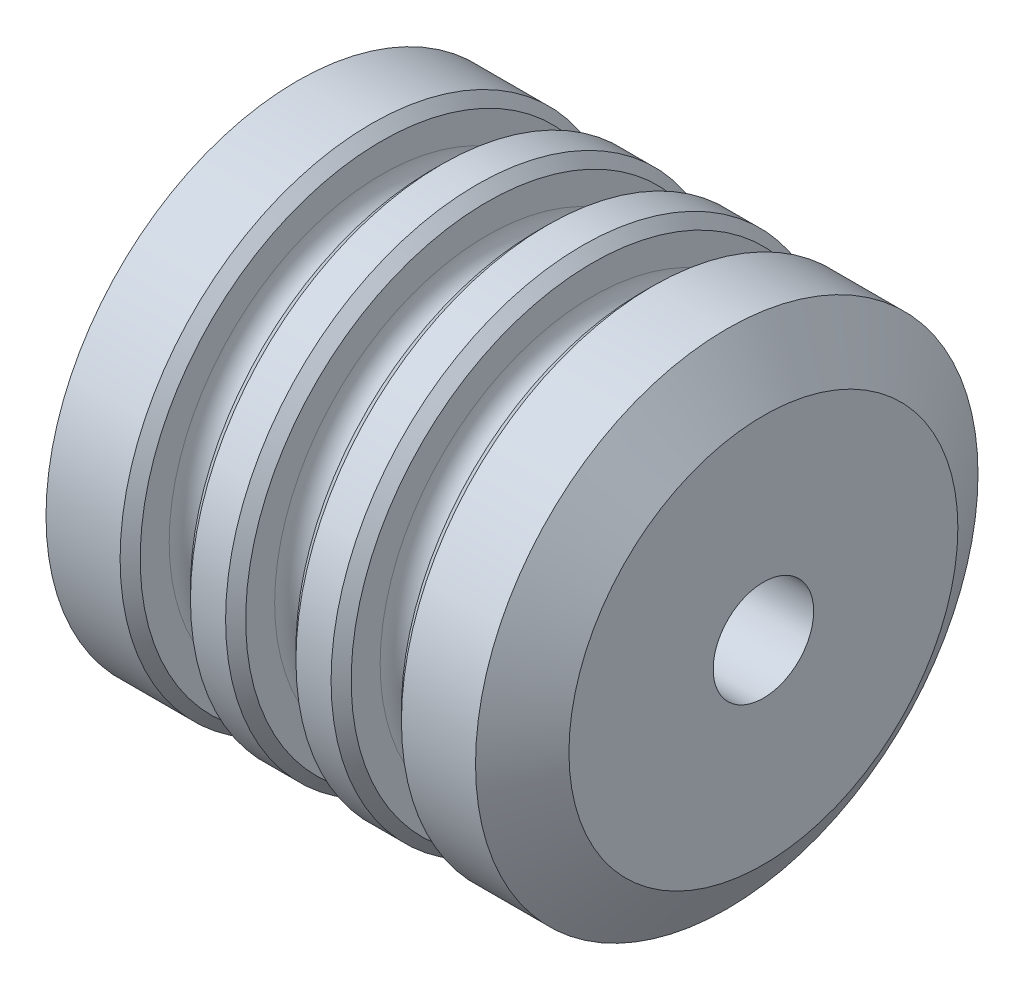
ISO-10303-21;
HEADER;
FILE_DESCRIPTION(('STEP AP214'),'2;1');
FILE_NAME('part.step','',(''),(''),'','','');
FILE_SCHEMA(('AUTOMOTIVE_DESIGN { 1 0 10303 214 1 1 1 1 }'));
ENDSEC;
DATA;
#1=APPLICATION_CONTEXT('core data for automotive mechanical design processes');
#2=APPLICATION_PROTOCOL_DEFINITION('international standard','automotive_design',2000,#1);
#3=PRODUCT_CONTEXT('',#1,'mechanical');
#4=PRODUCT('Part','Part','',(#3));
#5=PRODUCT_RELATED_PRODUCT_CATEGORY('part','',(#4));
#6=PRODUCT_DEFINITION_FORMATION('','',#4);
#7=PRODUCT_DEFINITION_CONTEXT('part definition',#1,'design');
#8=PRODUCT_DEFINITION('design','',#6,#7);
#9=PRODUCT_DEFINITION_SHAPE('','',#8);
#10=(LENGTH_UNIT() NAMED_UNIT(*) SI_UNIT(.MILLI.,.METRE.));
#11=(NAMED_UNIT(*) PLANE_ANGLE_UNIT() SI_UNIT($,.RADIAN.));
#12=(NAMED_UNIT(*) SI_UNIT($,.STERADIAN.) SOLID_ANGLE_UNIT());
#13=UNCERTAINTY_MEASURE_WITH_UNIT(LENGTH_MEASURE(1.E-05),#10,'distance_accuracy_value','');
#14=(GEOMETRIC_REPRESENTATION_CONTEXT(3) GLOBAL_UNCERTAINTY_ASSIGNED_CONTEXT((#13)) GLOBAL_UNIT_ASSIGNED_CONTEXT((#10,
#11,#12)) REPRESENTATION_CONTEXT('',''));
#15=CARTESIAN_POINT('',(0.,0.,0.));
#16=DIRECTION('',(0.,0.,1.));
#17=DIRECTION('',(1.,0.,0.));
#18=AXIS2_PLACEMENT_3D('',#15,#16,#17);
#19=CARTESIAN_POINT('',(-500.326507310997,193.507761945142,0.));
#20=DIRECTION('',(-1.,0.,0.));
#21=DIRECTION('',(0.,0.,1.));
#22=AXIS2_PLACEMENT_3D('',#19,#20,#21);
#23=PLANE('',#22);
#24=CARTESIAN_POINT('',(-500.326507310997,0.,0.));
#25=DIRECTION('',(-1.,0.,0.));
#26=DIRECTION('',(0.,0.,1.));
#27=AXIS2_PLACEMENT_3D('',#24,#25,#26);
#28=CIRCLE('',#27,50.);
#29=CARTESIAN_POINT('',(-500.326507310997,0.,50.));
#30=VERTEX_POINT('',#29);
#31=EDGE_CURVE('E122',#30,#30,#28,.T.);
#32=ORIENTED_EDGE('',*,*,#31,.F.);
#33=EDGE_LOOP('',(#32));
#34=FACE_BOUND('',#33,.T.);
#35=CARTESIAN_POINT('',(-500.326507310997,0.,0.));
#36=DIRECTION('',(1.,0.,0.));
#37=DIRECTION('',(0.,0.,-1.));
#38=AXIS2_PLACEMENT_3D('',#35,#36,#37);
#39=CIRCLE('',#38,193.507761945142);
#40=CARTESIAN_POINT('',(-500.326507310997,0.,-193.507761945142));
#41=VERTEX_POINT('',#40);
#42=EDGE_CURVE('E10',#41,#41,#39,.T.);
#43=ORIENTED_EDGE('',*,*,#42,.F.);
#44=EDGE_LOOP('',(#43));
#45=FACE_BOUND('',#44,.T.);
#46=ADVANCED_FACE('F31',(#34,#45),#23,.T.);
#47=CARTESIAN_POINT('',(-463.865135046205,0.,0.));
#48=DIRECTION('',(1.,0.,0.));
#49=DIRECTION('',(0.,0.,-1.));
#50=AXIS2_PLACEMENT_3D('',#47,#48,#49);
#51=CONICAL_SURFACE('',#50,250.,0.997645631784577);
#52=ORIENTED_EDGE('',*,*,#42,.T.);
#53=EDGE_LOOP('',(#52));
#54=FACE_BOUND('',#53,.T.);
#55=CARTESIAN_POINT('',(-463.865135046205,0.,0.));
#56=DIRECTION('',(1.,0.,0.));
#57=DIRECTION('',(0.,0.,-1.));
#58=AXIS2_PLACEMENT_3D('',#55,#56,#57);
#59=CIRCLE('',#58,250.);
#60=CARTESIAN_POINT('',(-463.865135046205,0.,-250.));
#61=VERTEX_POINT('',#60);
#62=EDGE_CURVE('E37',#61,#61,#59,.T.);
#63=ORIENTED_EDGE('',*,*,#62,.F.);
#64=EDGE_LOOP('',(#63));
#65=FACE_BOUND('',#64,.T.);
#66=ADVANCED_FACE('F149',(#54,#65),#51,.T.);
#67=CARTESIAN_POINT('',(0.,0.,0.));
#68=DIRECTION('',(1.,0.,0.));
#69=DIRECTION('',(0.,0.,-1.));
#70=AXIS2_PLACEMENT_3D('',#67,#68,#69);
#71=CYLINDRICAL_SURFACE('',#70,250.);
#72=ORIENTED_EDGE('',*,*,#62,.T.);
#73=EDGE_LOOP('',(#72));
#74=FACE_BOUND('',#73,.T.);
#75=CARTESIAN_POINT('',(-390.130675993658,0.,0.));
#76=DIRECTION('',(1.,0.,0.));
#77=DIRECTION('',(0.,0.,-1.));
#78=AXIS2_PLACEMENT_3D('',#75,#76,#77);
#79=CIRCLE('',#78,250.);
#80=CARTESIAN_POINT('',(-390.130675993658,0.,-250.));
#81=VERTEX_POINT('',#80);
#82=EDGE_CURVE('E41',#81,#81,#79,.T.);
#83=ORIENTED_EDGE('',*,*,#82,.F.);
#84=EDGE_LOOP('',(#83));
#85=FACE_BOUND('',#84,.T.);
#86=ADVANCED_FACE('F154',(#74,#85),#71,.T.);
#87=CARTESIAN_POINT('',(-380.130675993658,0.,0.));
#88=DIRECTION('',(-1.,0.,0.));
#89=DIRECTION('',(0.,0.,1.));
#90=AXIS2_PLACEMENT_3D('',#87,#88,#89);
#91=CONICAL_SURFACE('',#90,240.,0.785398163397448);
#92=ORIENTED_EDGE('',*,*,#82,.T.);
#93=EDGE_LOOP('',(#92));
#94=FACE_BOUND('',#93,.T.);
#95=CARTESIAN_POINT('',(-380.130675993658,0.,0.));
#96=DIRECTION('',(1.,0.,0.));
#97=DIRECTION('',(0.,0.,-1.));
#98=AXIS2_PLACEMENT_3D('',#95,#96,#97);
#99=CIRCLE('',#98,240.);
#100=CARTESIAN_POINT('',(-380.130675993658,0.,-240.));
#101=VERTEX_POINT('',#100);
#102=EDGE_CURVE('E45',#101,#101,#99,.T.);
#103=ORIENTED_EDGE('',*,*,#102,.F.);
#104=EDGE_LOOP('',(#103));
#105=FACE_BOUND('',#104,.T.);
#106=ADVANCED_FACE('F400',(#94,#105),#91,.T.);
#107=CARTESIAN_POINT('',(-380.130675993658,211.162162162162,0.));
#108=DIRECTION('',(1.,0.,0.));
#109=DIRECTION('',(0.,0.,-1.));
#110=AXIS2_PLACEMENT_3D('',#107,#108,#109);
#111=PLANE('',#110);
#112=ORIENTED_EDGE('',*,*,#102,.T.);
#113=EDGE_LOOP('',(#112));
#114=FACE_BOUND('',#113,.T.);
#115=CARTESIAN_POINT('',(-380.130675993658,0.,0.));
#116=DIRECTION('',(1.,0.,0.));
#117=DIRECTION('',(0.,0.,-1.));
#118=AXIS2_PLACEMENT_3D('',#115,#116,#117);
#119=CIRCLE('',#118,211.162162162162);
#120=CARTESIAN_POINT('',(-380.130675993658,0.,-211.162162162162));
#121=VERTEX_POINT('',#120);
#122=EDGE_CURVE('E50',#121,#121,#119,.T.);
#123=ORIENTED_EDGE('',*,*,#122,.F.);
#124=EDGE_LOOP('',(#123));
#125=FACE_BOUND('',#124,.T.);
#126=ADVANCED_FACE('F390',(#114,#125),#111,.T.);
#127=CARTESIAN_POINT('',(-356.130675993658,0.,0.));
#128=DIRECTION('',(1.,0.,0.));
#129=DIRECTION('',(0.,0.,-1.));
#130=AXIS2_PLACEMENT_3D('',#127,#128,#129);
#131=TOROIDAL_SURFACE('',#130,211.162162162162,24.);
#132=ORIENTED_EDGE('',*,*,#122,.T.);
#133=EDGE_LOOP('',(#132));
#134=FACE_BOUND('',#133,.T.);
#135=CARTESIAN_POINT('',(-356.130675993658,0.,0.));
#136=DIRECTION('',(1.,0.,0.));
#137=DIRECTION('',(0.,0.,-1.));
#138=AXIS2_PLACEMENT_3D('',#135,#136,#137);
#139=CIRCLE('',#138,187.162162162162);
#140=CARTESIAN_POINT('',(-356.130675993658,0.,-187.162162162162));
#141=VERTEX_POINT('',#140);
#142=EDGE_CURVE('E53',#141,#141,#139,.T.);
#143=ORIENTED_EDGE('',*,*,#142,.F.);
#144=EDGE_LOOP('',(#143));
#145=FACE_BOUND('',#144,.T.);
#146=ADVANCED_FACE('F380',(#134,#145),#131,.F.);
#147=CARTESIAN_POINT('',(0.,0.,0.));
#148=DIRECTION('',(1.,0.,0.));
#149=DIRECTION('',(0.,0.,-1.));
#150=AXIS2_PLACEMENT_3D('',#147,#148,#149);
#151=CYLINDRICAL_SURFACE('',#150,187.162162162162);
#152=ORIENTED_EDGE('',*,*,#142,.T.);
#153=EDGE_LOOP('',(#152));
#154=FACE_BOUND('',#153,.T.);
#155=CARTESIAN_POINT('',(-354.130675993658,0.,0.));
#156=DIRECTION('',(1.,0.,0.));
#157=DIRECTION('',(0.,0.,-1.));
#158=AXIS2_PLACEMENT_3D('',#155,#156,#157);
#159=CIRCLE('',#158,187.162162162162);
#160=CARTESIAN_POINT('',(-354.130675993658,0.,-187.162162162162));
#161=VERTEX_POINT('',#160);
#162=EDGE_CURVE('E56',#161,#161,#159,.T.);
#163=ORIENTED_EDGE('',*,*,#162,.F.);
#164=EDGE_LOOP('',(#163));
#165=FACE_BOUND('',#164,.T.);
#166=ADVANCED_FACE('F370',(#154,#165),#151,.T.);
#167=CARTESIAN_POINT('',(-354.130675993658,0.,0.));
#168=DIRECTION('',(1.,0.,0.));
#169=DIRECTION('',(0.,0.,-1.));
#170=AXIS2_PLACEMENT_3D('',#167,#168,#169);
#171=TOROIDAL_SURFACE('',#170,211.162162162162,24.);
#172=ORIENTED_EDGE('',*,*,#162,.T.);
#173=EDGE_LOOP('',(#172));
#174=FACE_BOUND('',#173,.T.);
#175=CARTESIAN_POINT('',(-330.130675993658,0.,0.));
#176=DIRECTION('',(1.,0.,0.));
#177=DIRECTION('',(0.,0.,-1.));
#178=AXIS2_PLACEMENT_3D('',#175,#176,#177);
#179=CIRCLE('',#178,211.162162162162);
#180=CARTESIAN_POINT('',(-330.130675993658,0.,-211.162162162162));
#181=VERTEX_POINT('',#180);
#182=EDGE_CURVE('E59',#181,#181,#179,.T.);
#183=ORIENTED_EDGE('',*,*,#182,.F.);
#184=EDGE_LOOP('',(#183));
#185=FACE_BOUND('',#184,.T.);
#186=ADVANCED_FACE('F360',(#174,#185),#171,.F.);
#187=CARTESIAN_POINT('',(-330.130675993658,240.,0.));
#188=DIRECTION('',(-1.,0.,0.));
#189=DIRECTION('',(0.,0.,1.));
#190=AXIS2_PLACEMENT_3D('',#187,#188,#189);
#191=PLANE('',#190);
#192=ORIENTED_EDGE('',*,*,#182,.T.);
#193=EDGE_LOOP('',(#192));
#194=FACE_BOUND('',#193,.T.);
#195=CARTESIAN_POINT('',(-330.130675993658,0.,0.));
#196=DIRECTION('',(1.,0.,0.));
#197=DIRECTION('',(0.,0.,-1.));
#198=AXIS2_PLACEMENT_3D('',#195,#196,#197);
#199=CIRCLE('',#198,240.);
#200=CARTESIAN_POINT('',(-330.130675993658,0.,-240.));
#201=VERTEX_POINT('',#200);
#202=EDGE_CURVE('E62',#201,#201,#199,.T.);
#203=ORIENTED_EDGE('',*,*,#202,.F.);
#204=EDGE_LOOP('',(#203));
#205=FACE_BOUND('',#204,.T.);
#206=ADVANCED_FACE('F350',(#194,#205),#191,.T.);
#207=CARTESIAN_POINT('',(-320.130675993658,0.,0.));
#208=DIRECTION('',(1.,0.,0.));
#209=DIRECTION('',(0.,0.,-1.));
#210=AXIS2_PLACEMENT_3D('',#207,#208,#209);
#211=CONICAL_SURFACE('',#210,250.,0.785398163397443);
#212=ORIENTED_EDGE('',*,*,#202,.T.);
#213=EDGE_LOOP('',(#212));
#214=FACE_BOUND('',#213,.T.);
#215=CARTESIAN_POINT('',(-320.130675993658,0.,0.));
#216=DIRECTION('',(1.,0.,0.));
#217=DIRECTION('',(0.,0.,-1.));
#218=AXIS2_PLACEMENT_3D('',#215,#216,#217);
#219=CIRCLE('',#218,250.);
#220=CARTESIAN_POINT('',(-320.130675993658,0.,-250.));
#221=VERTEX_POINT('',#220);
#222=EDGE_CURVE('E65',#221,#221,#219,.T.);
#223=ORIENTED_EDGE('',*,*,#222,.F.);
#224=EDGE_LOOP('',(#223));
#225=FACE_BOUND('',#224,.T.);
#226=ADVANCED_FACE('F340',(#214,#225),#211,.T.);
#227=CARTESIAN_POINT('',(0.,0.,0.));
#228=DIRECTION('',(1.,0.,0.));
#229=DIRECTION('',(0.,0.,-1.));
#230=AXIS2_PLACEMENT_3D('',#227,#228,#229);
#231=CYLINDRICAL_SURFACE('',#230,250.);
#232=ORIENTED_EDGE('',*,*,#222,.T.);
#233=EDGE_LOOP('',(#232));
#234=FACE_BOUND('',#233,.T.);
#235=CARTESIAN_POINT('',(-285.163253655498,0.,0.));
#236=DIRECTION('',(1.,0.,0.));
#237=DIRECTION('',(0.,0.,-1.));
#238=AXIS2_PLACEMENT_3D('',#235,#236,#237);
#239=CIRCLE('',#238,250.);
#240=CARTESIAN_POINT('',(-285.163253655498,0.,-250.));
#241=VERTEX_POINT('',#240);
#242=EDGE_CURVE('E68',#241,#241,#239,.T.);
#243=ORIENTED_EDGE('',*,*,#242,.F.);
#244=EDGE_LOOP('',(#243));
#245=FACE_BOUND('',#244,.T.);
#246=ADVANCED_FACE('F330',(#234,#245),#231,.T.);
#247=CARTESIAN_POINT('',(-275.163253655498,0.,0.));
#248=DIRECTION('',(-1.,0.,0.));
#249=DIRECTION('',(0.,0.,1.));
#250=AXIS2_PLACEMENT_3D('',#247,#248,#249);
#251=CONICAL_SURFACE('',#250,240.,0.785398163397457);
#252=ORIENTED_EDGE('',*,*,#242,.T.);
#253=EDGE_LOOP('',(#252));
#254=FACE_BOUND('',#253,.T.);
#255=CARTESIAN_POINT('',(-275.163253655498,0.,0.));
#256=DIRECTION('',(1.,0.,0.));
#257=DIRECTION('',(0.,0.,-1.));
#258=AXIS2_PLACEMENT_3D('',#255,#256,#257);
#259=CIRCLE('',#258,240.);
#260=CARTESIAN_POINT('',(-275.163253655498,0.,-240.));
#261=VERTEX_POINT('',#260);
#262=EDGE_CURVE('E71',#261,#261,#259,.T.);
#263=ORIENTED_EDGE('',*,*,#262,.F.);
#264=EDGE_LOOP('',(#263));
#265=FACE_BOUND('',#264,.T.);
#266=ADVANCED_FACE('F320',(#254,#265),#251,.T.);
#267=CARTESIAN_POINT('',(-275.163253655498,211.162162162162,0.));
#268=DIRECTION('',(1.,0.,0.));
#269=DIRECTION('',(0.,0.,-1.));
#270=AXIS2_PLACEMENT_3D('',#267,#268,#269);
#271=PLANE('',#270);
#272=ORIENTED_EDGE('',*,*,#262,.T.);
#273=EDGE_LOOP('',(#272));
#274=FACE_BOUND('',#273,.T.);
#275=CARTESIAN_POINT('',(-275.163253655498,0.,0.));
#276=DIRECTION('',(1.,0.,0.));
#277=DIRECTION('',(0.,0.,-1.));
#278=AXIS2_PLACEMENT_3D('',#275,#276,#277);
#279=CIRCLE('',#278,211.162162162162);
#280=CARTESIAN_POINT('',(-275.163253655498,0.,-211.162162162162));
#281=VERTEX_POINT('',#280);
#282=EDGE_CURVE('E74',#281,#281,#279,.T.);
#283=ORIENTED_EDGE('',*,*,#282,.F.);
#284=EDGE_LOOP('',(#283));
#285=FACE_BOUND('',#284,.T.);
#286=ADVANCED_FACE('F310',(#274,#285),#271,.T.);
#287=CARTESIAN_POINT('',(-251.163253655498,0.,0.));
#288=DIRECTION('',(1.,0.,0.));
#289=DIRECTION('',(0.,0.,-1.));
#290=AXIS2_PLACEMENT_3D('',#287,#288,#289);
#291=TOROIDAL_SURFACE('',#290,211.162162162162,24.);
#292=ORIENTED_EDGE('',*,*,#282,.T.);
#293=EDGE_LOOP('',(#292));
#294=FACE_BOUND('',#293,.T.);
#295=CARTESIAN_POINT('',(-251.163253655498,0.,0.));
#296=DIRECTION('',(1.,0.,0.));
#297=DIRECTION('',(0.,0.,-1.));
#298=AXIS2_PLACEMENT_3D('',#295,#296,#297);
#299=CIRCLE('',#298,187.162162162162);
#300=CARTESIAN_POINT('',(-251.163253655498,0.,-187.162162162162));
#301=VERTEX_POINT('',#300);
#302=EDGE_CURVE('E77',#301,#301,#299,.T.);
#303=ORIENTED_EDGE('',*,*,#302,.F.);
#304=EDGE_LOOP('',(#303));
#305=FACE_BOUND('',#304,.T.);
#306=ADVANCED_FACE('F300',(#294,#305),#291,.F.);
#307=CARTESIAN_POINT('',(0.,0.,0.));
#308=DIRECTION('',(1.,0.,0.));
#309=DIRECTION('',(0.,0.,-1.));
#310=AXIS2_PLACEMENT_3D('',#307,#308,#309);
#311=CYLINDRICAL_SURFACE('',#310,187.162162162162);
#312=ORIENTED_EDGE('',*,*,#302,.T.);
#313=EDGE_LOOP('',(#312));
#314=FACE_BOUND('',#313,.T.);
#315=CARTESIAN_POINT('',(-249.163253655499,0.,0.));
#316=DIRECTION('',(1.,0.,0.));
#317=DIRECTION('',(0.,0.,-1.));
#318=AXIS2_PLACEMENT_3D('',#315,#316,#317);
#319=CIRCLE('',#318,187.162162162162);
#320=CARTESIAN_POINT('',(-249.163253655499,0.,-187.162162162162));
#321=VERTEX_POINT('',#320);
#322=EDGE_CURVE('E80',#321,#321,#319,.T.);
#323=ORIENTED_EDGE('',*,*,#322,.F.);
#324=EDGE_LOOP('',(#323));
#325=FACE_BOUND('',#324,.T.);
#326=ADVANCED_FACE('F290',(#314,#325),#311,.T.);
#327=CARTESIAN_POINT('',(-249.163253655498,0.,0.));
#328=DIRECTION('',(1.,0.,0.));
#329=DIRECTION('',(0.,0.,-1.));
#330=AXIS2_PLACEMENT_3D('',#327,#328,#329);
#331=TOROIDAL_SURFACE('',#330,211.162162162162,24.);
#332=ORIENTED_EDGE('',*,*,#322,.T.);
#333=EDGE_LOOP('',(#332));
#334=FACE_BOUND('',#333,.T.);
#335=CARTESIAN_POINT('',(-225.163253655498,0.,0.));
#336=DIRECTION('',(1.,0.,0.));
#337=DIRECTION('',(0.,0.,-1.));
#338=AXIS2_PLACEMENT_3D('',#335,#336,#337);
#339=CIRCLE('',#338,211.162162162162);
#340=CARTESIAN_POINT('',(-225.163253655498,0.,-211.162162162162));
#341=VERTEX_POINT('',#340);
#342=EDGE_CURVE('E83',#341,#341,#339,.T.);
#343=ORIENTED_EDGE('',*,*,#342,.F.);
#344=EDGE_LOOP('',(#343));
#345=FACE_BOUND('',#344,.T.);
#346=ADVANCED_FACE('F280',(#334,#345),#331,.F.);
#347=CARTESIAN_POINT('',(-225.163253655498,240.,0.));
#348=DIRECTION('',(-1.,0.,0.));
#349=DIRECTION('',(0.,0.,1.));
#350=AXIS2_PLACEMENT_3D('',#347,#348,#349);
#351=PLANE('',#350);
#352=ORIENTED_EDGE('',*,*,#342,.T.);
#353=EDGE_LOOP('',(#352));
#354=FACE_BOUND('',#353,.T.);
#355=CARTESIAN_POINT('',(-225.163253655498,0.,0.));
#356=DIRECTION('',(1.,0.,0.));
#357=DIRECTION('',(0.,0.,-1.));
#358=AXIS2_PLACEMENT_3D('',#355,#356,#357);
#359=CIRCLE('',#358,240.);
#360=CARTESIAN_POINT('',(-225.163253655498,0.,-240.));
#361=VERTEX_POINT('',#360);
#362=EDGE_CURVE('E86',#361,#361,#359,.T.);
#363=ORIENTED_EDGE('',*,*,#362,.F.);
#364=EDGE_LOOP('',(#363));
#365=FACE_BOUND('',#364,.T.);
#366=ADVANCED_FACE('F270',(#354,#365),#351,.T.);
#367=CARTESIAN_POINT('',(-215.163253655498,0.,0.));
#368=DIRECTION('',(1.,0.,0.));
#369=DIRECTION('',(0.,0.,-1.));
#370=AXIS2_PLACEMENT_3D('',#367,#368,#369);
#371=CONICAL_SURFACE('',#370,250.,0.785398163397434);
#372=ORIENTED_EDGE('',*,*,#362,.T.);
#373=EDGE_LOOP('',(#372));
#374=FACE_BOUND('',#373,.T.);
#375=CARTESIAN_POINT('',(-215.163253655498,0.,0.));
#376=DIRECTION('',(1.,0.,0.));
#377=DIRECTION('',(0.,0.,-1.));
#378=AXIS2_PLACEMENT_3D('',#375,#376,#377);
#379=CIRCLE('',#378,250.);
#380=CARTESIAN_POINT('',(-215.163253655498,0.,-250.));
#381=VERTEX_POINT('',#380);
#382=EDGE_CURVE('E89',#381,#381,#379,.T.);
#383=ORIENTED_EDGE('',*,*,#382,.F.);
#384=EDGE_LOOP('',(#383));
#385=FACE_BOUND('',#384,.T.);
#386=ADVANCED_FACE('F260',(#374,#385),#371,.T.);
#387=CARTESIAN_POINT('',(0.,0.,0.));
#388=DIRECTION('',(1.,0.,0.));
#389=DIRECTION('',(0.,0.,-1.));
#390=AXIS2_PLACEMENT_3D('',#387,#388,#389);
#391=CYLINDRICAL_SURFACE('',#390,250.);
#392=ORIENTED_EDGE('',*,*,#382,.T.);
#393=EDGE_LOOP('',(#392));
#394=FACE_BOUND('',#393,.T.);
#395=CARTESIAN_POINT('',(-180.195831317339,0.,0.));
#396=DIRECTION('',(1.,0.,0.));
#397=DIRECTION('',(0.,0.,-1.));
#398=AXIS2_PLACEMENT_3D('',#395,#396,#397);
#399=CIRCLE('',#398,250.);
#400=CARTESIAN_POINT('',(-180.195831317339,0.,-250.));
#401=VERTEX_POINT('',#400);
#402=EDGE_CURVE('E92',#401,#401,#399,.T.);
#403=ORIENTED_EDGE('',*,*,#402,.F.);
#404=EDGE_LOOP('',(#403));
#405=FACE_BOUND('',#404,.T.);
#406=ADVANCED_FACE('F250',(#394,#405),#391,.T.);
#407=CARTESIAN_POINT('',(-170.195831317338,0.,0.));
#408=DIRECTION('',(-1.,0.,0.));
#409=DIRECTION('',(0.,0.,1.));
#410=AXIS2_PLACEMENT_3D('',#407,#408,#409);
#411=CONICAL_SURFACE('',#410,240.,0.785398163397461);
#412=ORIENTED_EDGE('',*,*,#402,.T.);
#413=EDGE_LOOP('',(#412));
#414=FACE_BOUND('',#413,.T.);
#415=CARTESIAN_POINT('',(-170.195831317338,0.,0.));
#416=DIRECTION('',(1.,0.,0.));
#417=DIRECTION('',(0.,0.,-1.));
#418=AXIS2_PLACEMENT_3D('',#415,#416,#417);
#419=CIRCLE('',#418,240.);
#420=CARTESIAN_POINT('',(-170.195831317338,0.,-240.));
#421=VERTEX_POINT('',#420);
#422=EDGE_CURVE('E95',#421,#421,#419,.T.);
#423=ORIENTED_EDGE('',*,*,#422,.F.);
#424=EDGE_LOOP('',(#423));
#425=FACE_BOUND('',#424,.T.);
#426=ADVANCED_FACE('F240',(#414,#425),#411,.T.);
#427=CARTESIAN_POINT('',(-170.195831317338,211.162162162162,0.));
#428=DIRECTION('',(1.,0.,0.));
#429=DIRECTION('',(0.,0.,-1.));
#430=AXIS2_PLACEMENT_3D('',#427,#428,#429);
#431=PLANE('',#430);
#432=ORIENTED_EDGE('',*,*,#422,.T.);
#433=EDGE_LOOP('',(#432));
#434=FACE_BOUND('',#433,.T.);
#435=CARTESIAN_POINT('',(-170.195831317338,0.,0.));
#436=DIRECTION('',(1.,0.,0.));
#437=DIRECTION('',(0.,0.,-1.));
#438=AXIS2_PLACEMENT_3D('',#435,#436,#437);
#439=CIRCLE('',#438,211.162162162162);
#440=CARTESIAN_POINT('',(-170.195831317338,0.,-211.162162162162));
#441=VERTEX_POINT('',#440);
#442=EDGE_CURVE('E98',#441,#441,#439,.T.);
#443=ORIENTED_EDGE('',*,*,#442,.F.);
#444=EDGE_LOOP('',(#443));
#445=FACE_BOUND('',#444,.T.);
#446=ADVANCED_FACE('F230',(#434,#445),#431,.T.);
#447=CARTESIAN_POINT('',(-146.195831317338,0.,0.));
#448=DIRECTION('',(1.,0.,0.));
#449=DIRECTION('',(0.,0.,-1.));
#450=AXIS2_PLACEMENT_3D('',#447,#448,#449);
#451=TOROIDAL_SURFACE('',#450,211.162162162162,24.);
#452=ORIENTED_EDGE('',*,*,#442,.T.);
#453=EDGE_LOOP('',(#452));
#454=FACE_BOUND('',#453,.T.);
#455=CARTESIAN_POINT('',(-146.195831317338,0.,0.));
#456=DIRECTION('',(1.,0.,0.));
#457=DIRECTION('',(0.,0.,-1.));
#458=AXIS2_PLACEMENT_3D('',#455,#456,#457);
#459=CIRCLE('',#458,187.162162162162);
#460=CARTESIAN_POINT('',(-146.195831317338,0.,-187.162162162162));
#461=VERTEX_POINT('',#460);
#462=EDGE_CURVE('E101',#461,#461,#459,.T.);
#463=ORIENTED_EDGE('',*,*,#462,.F.);
#464=EDGE_LOOP('',(#463));
#465=FACE_BOUND('',#464,.T.);
#466=ADVANCED_FACE('F220',(#454,#465),#451,.F.);
#467=CARTESIAN_POINT('',(0.,0.,0.));
#468=DIRECTION('',(1.,0.,0.));
#469=DIRECTION('',(0.,0.,-1.));
#470=AXIS2_PLACEMENT_3D('',#467,#468,#469);
#471=CYLINDRICAL_SURFACE('',#470,187.162162162162);
#472=ORIENTED_EDGE('',*,*,#462,.T.);
#473=EDGE_LOOP('',(#472));
#474=FACE_BOUND('',#473,.T.);
#475=CARTESIAN_POINT('',(-144.195831317339,0.,0.));
#476=DIRECTION('',(1.,0.,0.));
#477=DIRECTION('',(0.,0.,-1.));
#478=AXIS2_PLACEMENT_3D('',#475,#476,#477);
#479=CIRCLE('',#478,187.162162162162);
#480=CARTESIAN_POINT('',(-144.195831317339,0.,-187.162162162162));
#481=VERTEX_POINT('',#480);
#482=EDGE_CURVE('E104',#481,#481,#479,.T.);
#483=ORIENTED_EDGE('',*,*,#482,.F.);
#484=EDGE_LOOP('',(#483));
#485=FACE_BOUND('',#484,.T.);
#486=ADVANCED_FACE('F210',(#474,#485),#471,.T.);
#487=CARTESIAN_POINT('',(-144.195831317339,0.,0.));
#488=DIRECTION('',(1.,0.,0.));
#489=DIRECTION('',(0.,0.,-1.));
#490=AXIS2_PLACEMENT_3D('',#487,#488,#489);
#491=TOROIDAL_SURFACE('',#490,211.162162162162,24.);
#492=ORIENTED_EDGE('',*,*,#482,.T.);
#493=EDGE_LOOP('',(#492));
#494=FACE_BOUND('',#493,.T.);
#495=CARTESIAN_POINT('',(-120.195831317339,0.,0.));
#496=DIRECTION('',(1.,0.,0.));
#497=DIRECTION('',(0.,0.,-1.));
#498=AXIS2_PLACEMENT_3D('',#495,#496,#497);
#499=CIRCLE('',#498,211.162162162162);
#500=CARTESIAN_POINT('',(-120.195831317339,0.,-211.162162162162));
#501=VERTEX_POINT('',#500);
#502=EDGE_CURVE('E107',#501,#501,#499,.T.);
#503=ORIENTED_EDGE('',*,*,#502,.F.);
#504=EDGE_LOOP('',(#503));
#505=FACE_BOUND('',#504,.T.);
#506=ADVANCED_FACE('F200',(#494,#505),#491,.F.);
#507=CARTESIAN_POINT('',(-120.195831317339,240.,0.));
#508=DIRECTION('',(-1.,0.,0.));
#509=DIRECTION('',(0.,0.,1.));
#510=AXIS2_PLACEMENT_3D('',#507,#508,#509);
#511=PLANE('',#510);
#512=ORIENTED_EDGE('',*,*,#502,.T.);
#513=EDGE_LOOP('',(#512));
#514=FACE_BOUND('',#513,.T.);
#515=CARTESIAN_POINT('',(-120.195831317339,0.,0.));
#516=DIRECTION('',(1.,0.,0.));
#517=DIRECTION('',(0.,0.,-1.));
#518=AXIS2_PLACEMENT_3D('',#515,#516,#517);
#519=CIRCLE('',#518,240.);
#520=CARTESIAN_POINT('',(-120.195831317339,0.,-240.));
#521=VERTEX_POINT('',#520);
#522=EDGE_CURVE('E110',#521,#521,#519,.T.);
#523=ORIENTED_EDGE('',*,*,#522,.F.);
#524=EDGE_LOOP('',(#523));
#525=FACE_BOUND('',#524,.T.);
#526=ADVANCED_FACE('F190',(#514,#525),#511,.T.);
#527=CARTESIAN_POINT('',(-110.195831317338,0.,0.));
#528=DIRECTION('',(1.,0.,0.));
#529=DIRECTION('',(0.,0.,-1.));
#530=AXIS2_PLACEMENT_3D('',#527,#528,#529);
#531=CONICAL_SURFACE('',#530,250.,0.785398163397419);
#532=ORIENTED_EDGE('',*,*,#522,.T.);
#533=EDGE_LOOP('',(#532));
#534=FACE_BOUND('',#533,.T.);
#535=CARTESIAN_POINT('',(-110.195831317338,0.,0.));
#536=DIRECTION('',(1.,0.,0.));
#537=DIRECTION('',(0.,0.,-1.));
#538=AXIS2_PLACEMENT_3D('',#535,#536,#537);
#539=CIRCLE('',#538,250.);
#540=CARTESIAN_POINT('',(-110.195831317338,0.,-250.));
#541=VERTEX_POINT('',#540);
#542=EDGE_CURVE('E113',#541,#541,#539,.T.);
#543=ORIENTED_EDGE('',*,*,#542,.F.);
#544=EDGE_LOOP('',(#543));
#545=FACE_BOUND('',#544,.T.);
#546=ADVANCED_FACE('F145',(#534,#545),#531,.T.);
#547=CARTESIAN_POINT('',(0.,0.,0.));
#548=DIRECTION('',(1.,0.,0.));
#549=DIRECTION('',(0.,0.,-1.));
#550=AXIS2_PLACEMENT_3D('',#547,#548,#549);
#551=CYLINDRICAL_SURFACE('',#550,250.);
#552=ORIENTED_EDGE('',*,*,#542,.T.);
#553=EDGE_LOOP('',(#552));
#554=FACE_BOUND('',#553,.T.);
#555=CARTESIAN_POINT('',(-36.4613722647917,0.,0.));
#556=DIRECTION('',(1.,0.,0.));
#557=DIRECTION('',(0.,0.,-1.));
#558=AXIS2_PLACEMENT_3D('',#555,#556,#557);
#559=CIRCLE('',#558,250.);
#560=CARTESIAN_POINT('',(-36.4613722647917,0.,-250.));
#561=VERTEX_POINT('',#560);
#562=EDGE_CURVE('E116',#561,#561,#559,.T.);
#563=ORIENTED_EDGE('',*,*,#562,.F.);
#564=EDGE_LOOP('',(#563));
#565=FACE_BOUND('',#564,.T.);
#566=ADVANCED_FACE('F139',(#554,#565),#551,.T.);
#567=CARTESIAN_POINT('',(0.,0.,0.));
#568=DIRECTION('',(-1.,0.,0.));
#569=DIRECTION('',(0.,0.,1.));
#570=AXIS2_PLACEMENT_3D('',#567,#568,#569);
#571=CONICAL_SURFACE('',#570,193.507761945142,0.997645631784577);
#572=ORIENTED_EDGE('',*,*,#562,.T.);
#573=EDGE_LOOP('',(#572));
#574=FACE_BOUND('',#573,.T.);
#575=CARTESIAN_POINT('',(0.,0.,0.));
#576=DIRECTION('',(1.,0.,0.));
#577=DIRECTION('',(0.,0.,-1.));
#578=AXIS2_PLACEMENT_3D('',#575,#576,#577);
#579=CIRCLE('',#578,193.507761945142);
#580=CARTESIAN_POINT('',(0.,0.,-193.507761945142));
#581=VERTEX_POINT('',#580);
#582=EDGE_CURVE('E119',#581,#581,#579,.T.);
#583=ORIENTED_EDGE('',*,*,#582,.F.);
#584=EDGE_LOOP('',(#583));
#585=FACE_BOUND('',#584,.T.);
#586=ADVANCED_FACE('F134',(#574,#585),#571,.T.);
#587=CARTESIAN_POINT('',(0.,0.,0.));
#588=DIRECTION('',(1.,0.,0.));
#589=DIRECTION('',(0.,0.,-1.));
#590=AXIS2_PLACEMENT_3D('',#587,#588,#589);
#591=PLANE('',#590);
#592=CARTESIAN_POINT('',(0.,0.,0.));
#593=DIRECTION('',(1.,0.,0.));
#594=DIRECTION('',(0.,0.,-1.));
#595=AXIS2_PLACEMENT_3D('',#592,#593,#594);
#596=CIRCLE('',#595,50.);
#597=CARTESIAN_POINT('',(0.,0.,-50.));
#598=VERTEX_POINT('',#597);
#599=EDGE_CURVE('E125',#598,#598,#596,.T.);
#600=ORIENTED_EDGE('',*,*,#599,.F.);
#601=EDGE_LOOP('',(#600));
#602=FACE_BOUND('',#601,.T.);
#603=ORIENTED_EDGE('',*,*,#582,.T.);
#604=EDGE_LOOP('',(#603));
#605=FACE_BOUND('',#604,.T.);
#606=ADVANCED_FACE('F131',(#602,#605),#591,.T.);
#607=CARTESIAN_POINT('',(-550.,0.,0.));
#608=DIRECTION('',(1.,0.,0.));
#609=DIRECTION('',(0.,0.,-1.));
#610=AXIS2_PLACEMENT_3D('',#607,#608,#609);
#611=CYLINDRICAL_SURFACE('',#610,50.);
#612=ORIENTED_EDGE('',*,*,#31,.T.);
#613=EDGE_LOOP('',(#612));
#614=FACE_BOUND('',#613,.T.);
#615=ORIENTED_EDGE('',*,*,#599,.T.);
#616=EDGE_LOOP('',(#615));
#617=FACE_BOUND('',#616,.T.);
#618=ADVANCED_FACE('F129',(#614,#617),#611,.F.);
#619=CLOSED_SHELL('',(#46,#66,#86,#106,#126,#146,#166,#186,#206,#226,#246,#266,#286,#306,#326,
#346,#366,#386,#406,#426,#446,#466,#486,#506,#526,#546,#566,#586,#606,#618));
#620=MANIFOLD_SOLID_BREP('B2',#619);
#621=ADVANCED_BREP_SHAPE_REPRESENTATION('',(#18,#620),#14);
#622=SHAPE_DEFINITION_REPRESENTATION(#9,#621);
ENDSEC;
END-ISO-10303-21;
